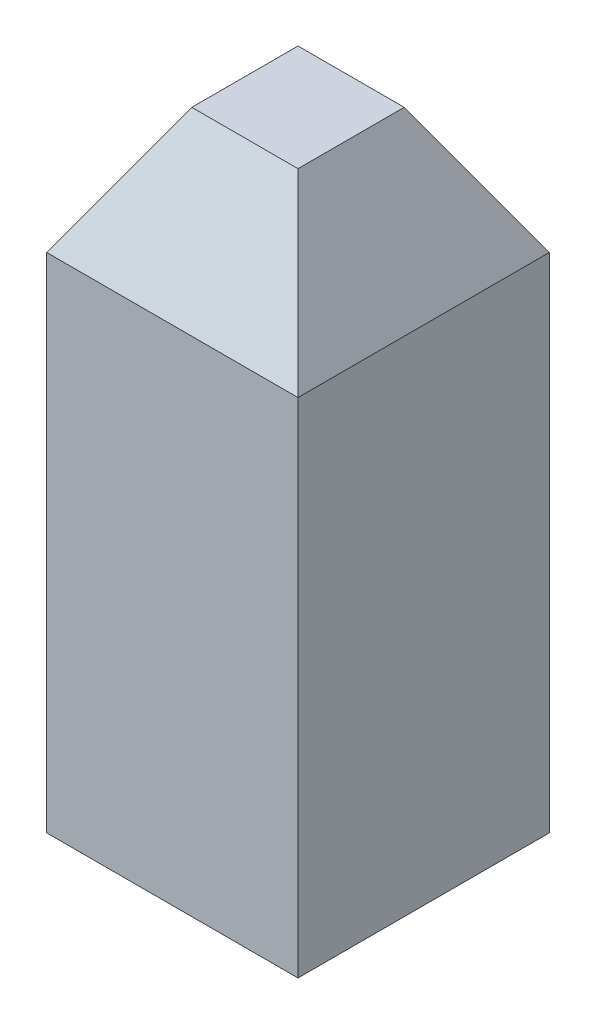
ISO-10303-21;
HEADER;
FILE_DESCRIPTION(('STEP AP214'),'2;1');
FILE_NAME('part.step','',(''),(''),'','','');
FILE_SCHEMA(('AUTOMOTIVE_DESIGN { 1 0 10303 214 1 1 1 1 }'));
ENDSEC;
DATA;
#1=APPLICATION_CONTEXT('core data for automotive mechanical design processes');
#2=APPLICATION_PROTOCOL_DEFINITION('international standard','automotive_design',2000,#1);
#3=PRODUCT_CONTEXT('',#1,'mechanical');
#4=PRODUCT('Part','Part','',(#3));
#5=PRODUCT_RELATED_PRODUCT_CATEGORY('part','',(#4));
#6=PRODUCT_DEFINITION_FORMATION('','',#4);
#7=PRODUCT_DEFINITION_CONTEXT('part definition',#1,'design');
#8=PRODUCT_DEFINITION('design','',#6,#7);
#9=PRODUCT_DEFINITION_SHAPE('','',#8);
#10=(LENGTH_UNIT() NAMED_UNIT(*) SI_UNIT(.MILLI.,.METRE.));
#11=(NAMED_UNIT(*) PLANE_ANGLE_UNIT() SI_UNIT($,.RADIAN.));
#12=(NAMED_UNIT(*) SI_UNIT($,.STERADIAN.) SOLID_ANGLE_UNIT());
#13=UNCERTAINTY_MEASURE_WITH_UNIT(LENGTH_MEASURE(1.E-05),#10,'distance_accuracy_value','');
#14=(GEOMETRIC_REPRESENTATION_CONTEXT(3) GLOBAL_UNCERTAINTY_ASSIGNED_CONTEXT((#13)) GLOBAL_UNIT_ASSIGNED_CONTEXT((#10,
#11,#12)) REPRESENTATION_CONTEXT('',''));
#15=CARTESIAN_POINT('',(0.,0.,0.));
#16=DIRECTION('',(0.,0.,1.));
#17=DIRECTION('',(1.,0.,0.));
#18=AXIS2_PLACEMENT_3D('',#15,#16,#17);
#19=CARTESIAN_POINT('',(0.25,0.5,0.25));
#20=DIRECTION('',(-1.,0.,0.));
#21=DIRECTION('',(0.,0.,1.));
#22=AXIS2_PLACEMENT_3D('',#19,#20,#21);
#23=PLANE('',#22);
#24=DIRECTION('',(0.,0.,-1.));
#25=VECTOR('',#24,1.);
#26=CARTESIAN_POINT('',(0.25,-0.5,0.25));
#27=LINE('',#26,#25);
#28=CARTESIAN_POINT('',(0.25,-0.5,0.25));
#29=VERTEX_POINT('',#28);
#30=CARTESIAN_POINT('',(0.25,-0.5,-0.25));
#31=VERTEX_POINT('',#30);
#32=EDGE_CURVE('E116',#29,#31,#27,.T.);
#33=ORIENTED_EDGE('',*,*,#32,.T.);
#34=DIRECTION('',(0.,-1.,0.));
#35=VECTOR('',#34,1.);
#36=CARTESIAN_POINT('',(0.25,0.5,-0.25));
#37=LINE('',#36,#35);
#38=CARTESIAN_POINT('',(0.25,0.5,-0.25));
#39=VERTEX_POINT('',#38);
#40=EDGE_CURVE('E11',#39,#31,#37,.T.);
#41=ORIENTED_EDGE('',*,*,#40,.F.);
#42=DIRECTION('',(0.,0.,-1.));
#43=VECTOR('',#42,1.);
#44=CARTESIAN_POINT('',(0.25,0.5,0.25));
#45=LINE('',#44,#43);
#46=CARTESIAN_POINT('',(0.25,0.5,0.25));
#47=VERTEX_POINT('',#46);
#48=EDGE_CURVE('E95',#47,#39,#45,.T.);
#49=ORIENTED_EDGE('',*,*,#48,.F.);
#50=DIRECTION('',(0.,-1.,0.));
#51=VECTOR('',#50,1.);
#52=CARTESIAN_POINT('',(0.25,0.5,0.25));
#53=LINE('',#52,#51);
#54=EDGE_CURVE('E97',#47,#29,#53,.T.);
#55=ORIENTED_EDGE('',*,*,#54,.T.);
#56=EDGE_LOOP('',(#33,#41,#49,#55));
#57=FACE_BOUND('',#56,.T.);
#58=ADVANCED_FACE('F35',(#57),#23,.F.);
#59=CARTESIAN_POINT('',(-0.25,0.5,-0.25));
#60=DIRECTION('',(0.,0.,1.));
#61=DIRECTION('',(1.,0.,0.));
#62=AXIS2_PLACEMENT_3D('',#59,#60,#61);
#63=PLANE('',#62);
#64=DIRECTION('',(-1.,0.,0.));
#65=VECTOR('',#64,1.);
#66=CARTESIAN_POINT('',(-0.25,-0.5,-0.25));
#67=LINE('',#66,#65);
#68=CARTESIAN_POINT('',(-0.25,-0.5,-0.25));
#69=VERTEX_POINT('',#68);
#70=EDGE_CURVE('E129',#31,#69,#67,.T.);
#71=ORIENTED_EDGE('',*,*,#70,.T.);
#72=DIRECTION('',(0.,-1.,0.));
#73=VECTOR('',#72,1.);
#74=CARTESIAN_POINT('',(-0.25,0.5,-0.25));
#75=LINE('',#74,#73);
#76=CARTESIAN_POINT('',(-0.25,0.5,-0.25));
#77=VERTEX_POINT('',#76);
#78=EDGE_CURVE('E43',#77,#69,#75,.T.);
#79=ORIENTED_EDGE('',*,*,#78,.F.);
#80=DIRECTION('',(-1.,0.,0.));
#81=VECTOR('',#80,1.);
#82=CARTESIAN_POINT('',(-0.25,0.5,-0.25));
#83=LINE('',#82,#81);
#84=EDGE_CURVE('E77',#39,#77,#83,.T.);
#85=ORIENTED_EDGE('',*,*,#84,.F.);
#86=ORIENTED_EDGE('',*,*,#40,.T.);
#87=EDGE_LOOP('',(#71,#79,#85,#86));
#88=FACE_BOUND('',#87,.T.);
#89=ADVANCED_FACE('F136',(#88),#63,.F.);
#90=CARTESIAN_POINT('',(-0.25,0.5,0.25));
#91=DIRECTION('',(1.,0.,0.));
#92=DIRECTION('',(0.,0.,-1.));
#93=AXIS2_PLACEMENT_3D('',#90,#91,#92);
#94=PLANE('',#93);
#95=DIRECTION('',(0.,0.,1.));
#96=VECTOR('',#95,1.);
#97=CARTESIAN_POINT('',(-0.25,-0.5,0.25));
#98=LINE('',#97,#96);
#99=CARTESIAN_POINT('',(-0.25,-0.5,0.25));
#100=VERTEX_POINT('',#99);
#101=EDGE_CURVE('E67',#69,#100,#98,.T.);
#102=ORIENTED_EDGE('',*,*,#101,.T.);
#103=DIRECTION('',(0.,-1.,0.));
#104=VECTOR('',#103,1.);
#105=CARTESIAN_POINT('',(-0.25,0.5,0.25));
#106=LINE('',#105,#104);
#107=CARTESIAN_POINT('',(-0.25,0.5,0.25));
#108=VERTEX_POINT('',#107);
#109=EDGE_CURVE('E51',#108,#100,#106,.T.);
#110=ORIENTED_EDGE('',*,*,#109,.F.);
#111=DIRECTION('',(0.,0.,1.));
#112=VECTOR('',#111,1.);
#113=CARTESIAN_POINT('',(-0.25,0.5,0.25));
#114=LINE('',#113,#112);
#115=EDGE_CURVE('E123',#77,#108,#114,.T.);
#116=ORIENTED_EDGE('',*,*,#115,.F.);
#117=ORIENTED_EDGE('',*,*,#78,.T.);
#118=EDGE_LOOP('',(#102,#110,#116,#117));
#119=FACE_BOUND('',#118,.T.);
#120=ADVANCED_FACE('F133',(#119),#94,.F.);
#121=CARTESIAN_POINT('',(-0.25,0.5,0.25));
#122=DIRECTION('',(0.,0.,-1.));
#123=DIRECTION('',(-1.,0.,0.));
#124=AXIS2_PLACEMENT_3D('',#121,#122,#123);
#125=PLANE('',#124);
#126=DIRECTION('',(1.,0.,0.));
#127=VECTOR('',#126,1.);
#128=CARTESIAN_POINT('',(-0.25,-0.5,0.25));
#129=LINE('',#128,#127);
#130=EDGE_CURVE('E72',#100,#29,#129,.T.);
#131=ORIENTED_EDGE('',*,*,#130,.T.);
#132=ORIENTED_EDGE('',*,*,#54,.F.);
#133=DIRECTION('',(1.,0.,0.));
#134=VECTOR('',#133,1.);
#135=CARTESIAN_POINT('',(-0.25,0.5,0.25));
#136=LINE('',#135,#134);
#137=EDGE_CURVE('E106',#108,#47,#136,.T.);
#138=ORIENTED_EDGE('',*,*,#137,.F.);
#139=ORIENTED_EDGE('',*,*,#109,.T.);
#140=EDGE_LOOP('',(#131,#132,#138,#139));
#141=FACE_BOUND('',#140,.T.);
#142=ADVANCED_FACE('F104',(#141),#125,.F.);
#143=CARTESIAN_POINT('',(0.,-0.5,0.));
#144=DIRECTION('',(0.,-1.,0.));
#145=DIRECTION('',(0.,0.,-1.));
#146=AXIS2_PLACEMENT_3D('',#143,#144,#145);
#147=PLANE('',#146);
#148=ORIENTED_EDGE('',*,*,#32,.F.);
#149=ORIENTED_EDGE('',*,*,#130,.F.);
#150=ORIENTED_EDGE('',*,*,#101,.F.);
#151=ORIENTED_EDGE('',*,*,#70,.F.);
#152=EDGE_LOOP('',(#148,#149,#150,#151));
#153=FACE_BOUND('',#152,.T.);
#154=ADVANCED_FACE('F135',(#153),#147,.T.);
#155=CARTESIAN_POINT('',(-0.25,0.5,0.25));
#156=DIRECTION('',(0.,0.5,0.866025403784438));
#157=DIRECTION('',(0.,-0.866025403784438,0.5));
#158=AXIS2_PLACEMENT_3D('',#155,#156,#157);
#159=PLANE('',#158);
#160=ORIENTED_EDGE('',*,*,#137,.T.);
#161=DIRECTION('',(0.447213595499958,-0.774596669241483,0.447213595499958));
#162=VECTOR('',#161,1.);
#163=CARTESIAN_POINT('',(0.25,0.5,0.25));
#164=LINE('',#163,#162);
#165=CARTESIAN_POINT('',(0.105662432702593,0.75,0.105662432702593));
#166=VERTEX_POINT('',#165);
#167=EDGE_CURVE('E110',#166,#47,#164,.T.);
#168=ORIENTED_EDGE('',*,*,#167,.F.);
#169=DIRECTION('',(-1.,0.,0.));
#170=VECTOR('',#169,1.);
#171=CARTESIAN_POINT('',(-0.25,0.75,0.105662432702593));
#172=LINE('',#171,#170);
#173=CARTESIAN_POINT('',(-0.105662432702593,0.75,0.105662432702593));
#174=VERTEX_POINT('',#173);
#175=EDGE_CURVE('E165',#174,#166,#172,.F.);
#176=ORIENTED_EDGE('',*,*,#175,.F.);
#177=DIRECTION('',(-0.447213595499958,-0.774596669241483,0.447213595499958));
#178=VECTOR('',#177,1.);
#179=CARTESIAN_POINT('',(-0.25,0.5,0.25));
#180=LINE('',#179,#178);
#181=EDGE_CURVE('E122',#174,#108,#180,.T.);
#182=ORIENTED_EDGE('',*,*,#181,.T.);
#183=EDGE_LOOP('',(#160,#168,#176,#182));
#184=FACE_BOUND('',#183,.T.);
#185=ADVANCED_FACE('F120',(#184),#159,.T.);
#186=CARTESIAN_POINT('',(0.25,0.5,0.25));
#187=DIRECTION('',(0.866025403784438,0.5,0.));
#188=DIRECTION('',(-0.5,0.866025403784438,0.));
#189=AXIS2_PLACEMENT_3D('',#186,#187,#188);
#190=PLANE('',#189);
#191=ORIENTED_EDGE('',*,*,#48,.T.);
#192=DIRECTION('',(0.447213595499958,-0.774596669241483,-0.447213595499958));
#193=VECTOR('',#192,1.);
#194=CARTESIAN_POINT('',(0.25,0.5,-0.25));
#195=LINE('',#194,#193);
#196=CARTESIAN_POINT('',(0.105662432702593,0.75,-0.105662432702593));
#197=VERTEX_POINT('',#196);
#198=EDGE_CURVE('E117',#197,#39,#195,.T.);
#199=ORIENTED_EDGE('',*,*,#198,.F.);
#200=DIRECTION('',(0.,0.,1.));
#201=VECTOR('',#200,1.);
#202=CARTESIAN_POINT('',(0.105662432702593,0.75,0.25));
#203=LINE('',#202,#201);
#204=EDGE_CURVE('E112',#166,#197,#203,.F.);
#205=ORIENTED_EDGE('',*,*,#204,.F.);
#206=ORIENTED_EDGE('',*,*,#167,.T.);
#207=EDGE_LOOP('',(#191,#199,#205,#206));
#208=FACE_BOUND('',#207,.T.);
#209=ADVANCED_FACE('F111',(#208),#190,.T.);
#210=CARTESIAN_POINT('',(0.25,0.5,-0.25));
#211=DIRECTION('',(0.,0.5,-0.866025403784438));
#212=DIRECTION('',(0.,0.866025403784438,0.5));
#213=AXIS2_PLACEMENT_3D('',#210,#211,#212);
#214=PLANE('',#213);
#215=ORIENTED_EDGE('',*,*,#84,.T.);
#216=DIRECTION('',(-0.447213595499958,-0.774596669241483,-0.447213595499958));
#217=VECTOR('',#216,1.);
#218=CARTESIAN_POINT('',(-0.25,0.5,-0.25));
#219=LINE('',#218,#217);
#220=CARTESIAN_POINT('',(-0.105662432702593,0.75,-0.105662432702593));
#221=VERTEX_POINT('',#220);
#222=EDGE_CURVE('E178',#221,#77,#219,.T.);
#223=ORIENTED_EDGE('',*,*,#222,.F.);
#224=DIRECTION('',(1.,0.,0.));
#225=VECTOR('',#224,1.);
#226=CARTESIAN_POINT('',(0.25,0.75,-0.105662432702593));
#227=LINE('',#226,#225);
#228=EDGE_CURVE('E169',#197,#221,#227,.F.);
#229=ORIENTED_EDGE('',*,*,#228,.F.);
#230=ORIENTED_EDGE('',*,*,#198,.T.);
#231=EDGE_LOOP('',(#215,#223,#229,#230));
#232=FACE_BOUND('',#231,.T.);
#233=ADVANCED_FACE('F150',(#232),#214,.T.);
#234=CARTESIAN_POINT('',(-0.25,0.5,-0.25));
#235=DIRECTION('',(-0.866025403784438,0.5,0.));
#236=DIRECTION('',(-0.5,-0.866025403784438,0.));
#237=AXIS2_PLACEMENT_3D('',#234,#235,#236);
#238=PLANE('',#237);
#239=ORIENTED_EDGE('',*,*,#115,.T.);
#240=ORIENTED_EDGE('',*,*,#181,.F.);
#241=DIRECTION('',(0.,0.,-1.));
#242=VECTOR('',#241,1.);
#243=CARTESIAN_POINT('',(-0.105662432702593,0.75,-0.25));
#244=LINE('',#243,#242);
#245=EDGE_CURVE('E167',#221,#174,#244,.F.);
#246=ORIENTED_EDGE('',*,*,#245,.F.);
#247=ORIENTED_EDGE('',*,*,#222,.T.);
#248=EDGE_LOOP('',(#239,#240,#246,#247));
#249=FACE_BOUND('',#248,.T.);
#250=ADVANCED_FACE('F153',(#249),#238,.T.);
#251=CARTESIAN_POINT('',(0.,0.75,0.));
#252=DIRECTION('',(0.,1.,0.));
#253=DIRECTION('',(0.,0.,1.));
#254=AXIS2_PLACEMENT_3D('',#251,#252,#253);
#255=PLANE('',#254);
#256=ORIENTED_EDGE('',*,*,#175,.T.);
#257=ORIENTED_EDGE('',*,*,#204,.T.);
#258=ORIENTED_EDGE('',*,*,#228,.T.);
#259=ORIENTED_EDGE('',*,*,#245,.T.);
#260=EDGE_LOOP('',(#256,#257,#258,#259));
#261=FACE_BOUND('',#260,.T.);
#262=ADVANCED_FACE('F157',(#261),#255,.T.);
#263=CLOSED_SHELL('',(#58,#89,#120,#142,#154,#185,#209,#233,#250,#262));
#264=MANIFOLD_SOLID_BREP('B2',#263);
#265=ADVANCED_BREP_SHAPE_REPRESENTATION('',(#18,#264),#14);
#266=SHAPE_DEFINITION_REPRESENTATION(#9,#265);
ENDSEC;
END-ISO-10303-21;
